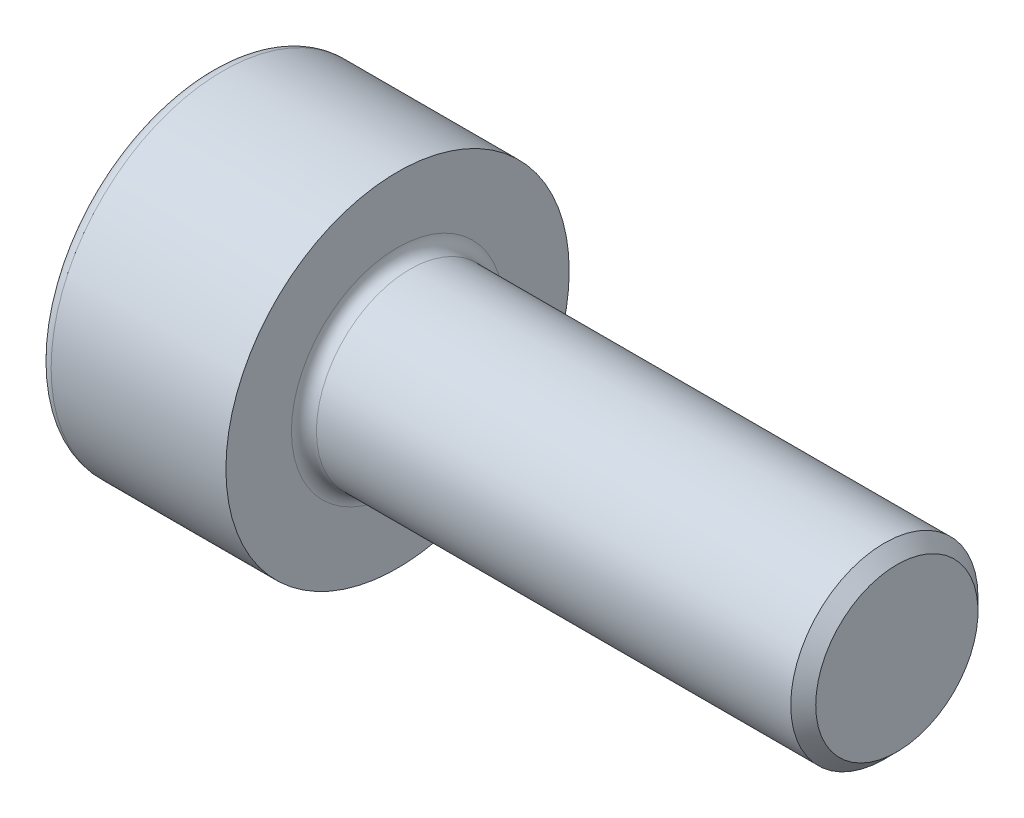
ISO-10303-21;
HEADER;
FILE_DESCRIPTION(('STEP AP214'),'2;1');
FILE_NAME('part.step','',(''),(''),'','','');
FILE_SCHEMA(('AUTOMOTIVE_DESIGN { 1 0 10303 214 1 1 1 1 }'));
ENDSEC;
DATA;
#1=APPLICATION_CONTEXT('core data for automotive mechanical design processes');
#2=APPLICATION_PROTOCOL_DEFINITION('international standard','automotive_design',2000,#1);
#3=PRODUCT_CONTEXT('',#1,'mechanical');
#4=PRODUCT('Part','Part','',(#3));
#5=PRODUCT_RELATED_PRODUCT_CATEGORY('part','',(#4));
#6=PRODUCT_DEFINITION_FORMATION('','',#4);
#7=PRODUCT_DEFINITION_CONTEXT('part definition',#1,'design');
#8=PRODUCT_DEFINITION('design','',#6,#7);
#9=PRODUCT_DEFINITION_SHAPE('','',#8);
#10=(LENGTH_UNIT() NAMED_UNIT(*) SI_UNIT(.MILLI.,.METRE.));
#11=(NAMED_UNIT(*) PLANE_ANGLE_UNIT() SI_UNIT($,.RADIAN.));
#12=(NAMED_UNIT(*) SI_UNIT($,.STERADIAN.) SOLID_ANGLE_UNIT());
#13=UNCERTAINTY_MEASURE_WITH_UNIT(LENGTH_MEASURE(1.E-05),#10,'distance_accuracy_value','');
#14=(GEOMETRIC_REPRESENTATION_CONTEXT(3) GLOBAL_UNCERTAINTY_ASSIGNED_CONTEXT((#13)) GLOBAL_UNIT_ASSIGNED_CONTEXT((#10,
#11,#12)) REPRESENTATION_CONTEXT('',''));
#15=CARTESIAN_POINT('',(0.,0.,0.));
#16=DIRECTION('',(0.,0.,1.));
#17=DIRECTION('',(1.,0.,0.));
#18=AXIS2_PLACEMENT_3D('',#15,#16,#17);
#19=CARTESIAN_POINT('',(0.,0.,0.));
#20=DIRECTION('',(1.,0.,0.));
#21=DIRECTION('',(0.,0.,-1.));
#22=AXIS2_PLACEMENT_3D('',#19,#20,#21);
#23=PLANE('',#22);
#24=DIRECTION('',(0.,0.866025403784439,0.5));
#25=VECTOR('',#24,1.);
#26=CARTESIAN_POINT('',(0.,-1.28,0.739008344562721));
#27=LINE('',#26,#25);
#28=CARTESIAN_POINT('',(0.,-1.28,0.739008344562721));
#29=VERTEX_POINT('',#28);
#30=CARTESIAN_POINT('',(0.,0.,1.47801668912544));
#31=VERTEX_POINT('',#30);
#32=EDGE_CURVE('E121',#29,#31,#27,.T.);
#33=ORIENTED_EDGE('',*,*,#32,.F.);
#34=DIRECTION('',(0.,0.,1.));
#35=VECTOR('',#34,1.);
#36=CARTESIAN_POINT('',(0.,-1.28,-0.739008344562721));
#37=LINE('',#36,#35);
#38=CARTESIAN_POINT('',(0.,-1.28,-0.739008344562721));
#39=VERTEX_POINT('',#38);
#40=EDGE_CURVE('E47',#39,#29,#37,.T.);
#41=ORIENTED_EDGE('',*,*,#40,.F.);
#42=DIRECTION('',(0.,-0.866025403784439,0.5));
#43=VECTOR('',#42,1.);
#44=CARTESIAN_POINT('',(0.,0.,-1.47801668912544));
#45=LINE('',#44,#43);
#46=CARTESIAN_POINT('',(0.,0.,-1.47801668912544));
#47=VERTEX_POINT('',#46);
#48=EDGE_CURVE('E130',#47,#39,#45,.T.);
#49=ORIENTED_EDGE('',*,*,#48,.F.);
#50=DIRECTION('',(0.,-0.866025403784439,-0.5));
#51=VECTOR('',#50,1.);
#52=CARTESIAN_POINT('',(0.,1.28,-0.739008344562721));
#53=LINE('',#52,#51);
#54=CARTESIAN_POINT('',(0.,1.28,-0.739008344562721));
#55=VERTEX_POINT('',#54);
#56=EDGE_CURVE('E128',#55,#47,#53,.T.);
#57=ORIENTED_EDGE('',*,*,#56,.F.);
#58=DIRECTION('',(0.,0.,-1.));
#59=VECTOR('',#58,1.);
#60=CARTESIAN_POINT('',(0.,1.28,0.739008344562721));
#61=LINE('',#60,#59);
#62=CARTESIAN_POINT('',(0.,1.28,0.739008344562721));
#63=VERTEX_POINT('',#62);
#64=EDGE_CURVE('E95',#63,#55,#61,.T.);
#65=ORIENTED_EDGE('',*,*,#64,.F.);
#66=DIRECTION('',(0.,0.866025403784438,-0.5));
#67=VECTOR('',#66,1.);
#68=CARTESIAN_POINT('',(0.,0.,1.47801668912544));
#69=LINE('',#68,#67);
#70=EDGE_CURVE('E124',#31,#63,#69,.T.);
#71=ORIENTED_EDGE('',*,*,#70,.F.);
#72=EDGE_LOOP('',(#33,#41,#49,#57,#65,#71));
#73=FACE_BOUND('',#72,.T.);
#74=CARTESIAN_POINT('',(0.,0.,0.));
#75=DIRECTION('',(1.,0.,0.));
#76=DIRECTION('',(0.,0.,-1.));
#77=AXIS2_PLACEMENT_3D('',#74,#75,#76);
#78=CIRCLE('',#77,2.55);
#79=CARTESIAN_POINT('',(0.,0.,-2.55));
#80=VERTEX_POINT('',#79);
#81=EDGE_CURVE('E40',#80,#80,#78,.F.);
#82=ORIENTED_EDGE('',*,*,#81,.T.);
#83=EDGE_LOOP('',(#82));
#84=FACE_BOUND('',#83,.T.);
#85=ADVANCED_FACE('F32',(#73,#84),#23,.F.);
#86=CARTESIAN_POINT('',(0.,0.,0.));
#87=DIRECTION('',(-1.,0.,0.));
#88=DIRECTION('',(0.,0.,1.));
#89=AXIS2_PLACEMENT_3D('',#86,#87,#88);
#90=CYLINDRICAL_SURFACE('',#89,2.75);
#91=CARTESIAN_POINT('',(0.2,0.,0.));
#92=DIRECTION('',(1.,0.,0.));
#93=DIRECTION('',(0.,0.,-1.));
#94=AXIS2_PLACEMENT_3D('',#91,#92,#93);
#95=CIRCLE('',#94,2.75);
#96=CARTESIAN_POINT('',(0.2,0.,-2.75));
#97=VERTEX_POINT('',#96);
#98=EDGE_CURVE('E11',#97,#97,#95,.T.);
#99=ORIENTED_EDGE('',*,*,#98,.T.);
#100=EDGE_LOOP('',(#99));
#101=FACE_BOUND('',#100,.T.);
#102=CARTESIAN_POINT('',(3.,0.,0.));
#103=DIRECTION('',(-1.,0.,0.));
#104=DIRECTION('',(0.,0.,1.));
#105=AXIS2_PLACEMENT_3D('',#102,#103,#104);
#106=CIRCLE('',#105,2.75);
#107=CARTESIAN_POINT('',(3.,0.,2.75));
#108=VERTEX_POINT('',#107);
#109=EDGE_CURVE('E134',#108,#108,#106,.T.);
#110=ORIENTED_EDGE('',*,*,#109,.T.);
#111=EDGE_LOOP('',(#110));
#112=FACE_BOUND('',#111,.T.);
#113=ADVANCED_FACE('F171',(#101,#112),#90,.T.);
#114=CARTESIAN_POINT('',(3.,2.75,0.));
#115=DIRECTION('',(-1.,0.,0.));
#116=DIRECTION('',(0.,0.,1.));
#117=AXIS2_PLACEMENT_3D('',#114,#115,#116);
#118=PLANE('',#117);
#119=CARTESIAN_POINT('',(3.,0.,0.));
#120=DIRECTION('',(-1.,0.,0.));
#121=DIRECTION('',(0.,0.,1.));
#122=AXIS2_PLACEMENT_3D('',#119,#120,#121);
#123=CIRCLE('',#122,1.7);
#124=CARTESIAN_POINT('',(3.,0.,1.7));
#125=VERTEX_POINT('',#124);
#126=EDGE_CURVE('E148',#125,#125,#123,.T.);
#127=ORIENTED_EDGE('',*,*,#126,.T.);
#128=EDGE_LOOP('',(#127));
#129=FACE_BOUND('',#128,.T.);
#130=ORIENTED_EDGE('',*,*,#109,.F.);
#131=EDGE_LOOP('',(#130));
#132=FACE_BOUND('',#131,.T.);
#133=ADVANCED_FACE('F177',(#129,#132),#118,.F.);
#134=CARTESIAN_POINT('',(0.,0.,0.));
#135=DIRECTION('',(-1.,0.,0.));
#136=DIRECTION('',(0.,0.,1.));
#137=AXIS2_PLACEMENT_3D('',#134,#135,#136);
#138=CYLINDRICAL_SURFACE('',#137,1.5);
#139=CARTESIAN_POINT('',(3.2,0.,0.));
#140=DIRECTION('',(-1.,0.,0.));
#141=DIRECTION('',(0.,0.,1.));
#142=AXIS2_PLACEMENT_3D('',#139,#140,#141);
#143=CIRCLE('',#142,1.5);
#144=CARTESIAN_POINT('',(3.2,0.,1.5));
#145=VERTEX_POINT('',#144);
#146=EDGE_CURVE('E151',#145,#145,#143,.F.);
#147=ORIENTED_EDGE('',*,*,#146,.T.);
#148=EDGE_LOOP('',(#147));
#149=FACE_BOUND('',#148,.T.);
#150=CARTESIAN_POINT('',(10.8,0.,0.));
#151=DIRECTION('',(-1.,0.,0.));
#152=DIRECTION('',(0.,0.,1.));
#153=AXIS2_PLACEMENT_3D('',#150,#151,#152);
#154=CIRCLE('',#153,1.5);
#155=CARTESIAN_POINT('',(10.8,0.,1.5));
#156=VERTEX_POINT('',#155);
#157=EDGE_CURVE('E142',#156,#156,#154,.T.);
#158=ORIENTED_EDGE('',*,*,#157,.T.);
#159=EDGE_LOOP('',(#158));
#160=FACE_BOUND('',#159,.T.);
#161=ADVANCED_FACE('F189',(#149,#160),#138,.T.);
#162=CARTESIAN_POINT('',(11.,1.5,0.));
#163=DIRECTION('',(-1.,0.,0.));
#164=DIRECTION('',(0.,0.,1.));
#165=AXIS2_PLACEMENT_3D('',#162,#163,#164);
#166=PLANE('',#165);
#167=CARTESIAN_POINT('',(11.,0.,0.));
#168=DIRECTION('',(-1.,0.,0.));
#169=DIRECTION('',(0.,0.,1.));
#170=AXIS2_PLACEMENT_3D('',#167,#168,#169);
#171=CIRCLE('',#170,1.3);
#172=CARTESIAN_POINT('',(11.,0.,1.3));
#173=VERTEX_POINT('',#172);
#174=EDGE_CURVE('E145',#173,#173,#171,.F.);
#175=ORIENTED_EDGE('',*,*,#174,.T.);
#176=EDGE_LOOP('',(#175));
#177=FACE_BOUND('',#176,.T.);
#178=ADVANCED_FACE('F184',(#177),#166,.F.);
#179=CARTESIAN_POINT('',(10.8,0.,0.));
#180=DIRECTION('',(-1.,0.,0.));
#181=DIRECTION('',(0.,0.,1.));
#182=AXIS2_PLACEMENT_3D('',#179,#180,#181);
#183=CONICAL_SURFACE('',#182,1.5,0.785398163397445);
#184=ORIENTED_EDGE('',*,*,#174,.F.);
#185=EDGE_LOOP('',(#184));
#186=FACE_BOUND('',#185,.T.);
#187=ORIENTED_EDGE('',*,*,#157,.F.);
#188=EDGE_LOOP('',(#187));
#189=FACE_BOUND('',#188,.T.);
#190=ADVANCED_FACE('F167',(#186,#189),#183,.T.);
#191=CARTESIAN_POINT('',(3.2,0.,0.));
#192=DIRECTION('',(-1.,0.,0.));
#193=DIRECTION('',(0.,0.,1.));
#194=AXIS2_PLACEMENT_3D('',#191,#192,#193);
#195=TOROIDAL_SURFACE('',#194,1.7,0.2);
#196=ORIENTED_EDGE('',*,*,#146,.F.);
#197=EDGE_LOOP('',(#196));
#198=FACE_BOUND('',#197,.T.);
#199=ORIENTED_EDGE('',*,*,#126,.F.);
#200=EDGE_LOOP('',(#199));
#201=FACE_BOUND('',#200,.T.);
#202=ADVANCED_FACE('F159',(#198,#201),#195,.F.);
#203=CARTESIAN_POINT('',(0.2,0.,0.));
#204=DIRECTION('',(1.,0.,0.));
#205=DIRECTION('',(0.,0.,-1.));
#206=AXIS2_PLACEMENT_3D('',#203,#204,#205);
#207=TOROIDAL_SURFACE('',#206,2.55,0.2);
#208=ORIENTED_EDGE('',*,*,#98,.F.);
#209=EDGE_LOOP('',(#208));
#210=FACE_BOUND('',#209,.T.);
#211=ORIENTED_EDGE('',*,*,#81,.F.);
#212=EDGE_LOOP('',(#211));
#213=FACE_BOUND('',#212,.T.);
#214=ADVANCED_FACE('F34',(#210,#213),#207,.T.);
#215=CARTESIAN_POINT('',(1.3,-1.28,-0.739008344562721));
#216=DIRECTION('',(0.,-1.,0.));
#217=DIRECTION('',(0.,0.,-1.));
#218=AXIS2_PLACEMENT_3D('',#215,#216,#217);
#219=PLANE('',#218);
#220=ORIENTED_EDGE('',*,*,#40,.T.);
#221=DIRECTION('',(-1.,0.,0.));
#222=VECTOR('',#221,1.);
#223=CARTESIAN_POINT('',(1.3,-1.28,0.739008344562721));
#224=LINE('',#223,#222);
#225=CARTESIAN_POINT('',(1.3,-1.28,0.739008344562721));
#226=VERTEX_POINT('',#225);
#227=EDGE_CURVE('E77',#226,#29,#224,.T.);
#228=ORIENTED_EDGE('',*,*,#227,.F.);
#229=DIRECTION('',(0.,0.,1.));
#230=VECTOR('',#229,1.);
#231=CARTESIAN_POINT('',(1.3,-1.28,-0.739008344562721));
#232=LINE('',#231,#230);
#233=CARTESIAN_POINT('',(1.3,-1.28,-0.739008344562721));
#234=VERTEX_POINT('',#233);
#235=EDGE_CURVE('E132',#234,#226,#232,.T.);
#236=ORIENTED_EDGE('',*,*,#235,.F.);
#237=DIRECTION('',(-1.,0.,0.));
#238=VECTOR('',#237,1.);
#239=CARTESIAN_POINT('',(1.3,-1.28,-0.739008344562721));
#240=LINE('',#239,#238);
#241=EDGE_CURVE('E55',#234,#39,#240,.T.);
#242=ORIENTED_EDGE('',*,*,#241,.T.);
#243=EDGE_LOOP('',(#220,#228,#236,#242));
#244=FACE_BOUND('',#243,.T.);
#245=ADVANCED_FACE('F158',(#244),#219,.F.);
#246=CARTESIAN_POINT('',(1.3,0.,-1.47801668912544));
#247=DIRECTION('',(0.,-0.5,-0.866025403784439));
#248=DIRECTION('',(0.,0.866025403784439,-0.5));
#249=AXIS2_PLACEMENT_3D('',#246,#247,#248);
#250=PLANE('',#249);
#251=ORIENTED_EDGE('',*,*,#48,.T.);
#252=ORIENTED_EDGE('',*,*,#241,.F.);
#253=DIRECTION('',(0.,-0.866025403784439,0.5));
#254=VECTOR('',#253,1.);
#255=CARTESIAN_POINT('',(1.3,0.,-1.47801668912544));
#256=LINE('',#255,#254);
#257=CARTESIAN_POINT('',(1.3,0.,-1.47801668912544));
#258=VERTEX_POINT('',#257);
#259=EDGE_CURVE('E107',#258,#234,#256,.T.);
#260=ORIENTED_EDGE('',*,*,#259,.F.);
#261=DIRECTION('',(-1.,0.,0.));
#262=VECTOR('',#261,1.);
#263=CARTESIAN_POINT('',(1.3,0.,-1.47801668912544));
#264=LINE('',#263,#262);
#265=EDGE_CURVE('E99',#258,#47,#264,.T.);
#266=ORIENTED_EDGE('',*,*,#265,.T.);
#267=EDGE_LOOP('',(#251,#252,#260,#266));
#268=FACE_BOUND('',#267,.T.);
#269=ADVANCED_FACE('F165',(#268),#250,.F.);
#270=CARTESIAN_POINT('',(1.3,1.28,-0.739008344562721));
#271=DIRECTION('',(0.,0.5,-0.866025403784439));
#272=DIRECTION('',(0.,0.866025403784439,0.5));
#273=AXIS2_PLACEMENT_3D('',#270,#271,#272);
#274=PLANE('',#273);
#275=ORIENTED_EDGE('',*,*,#56,.T.);
#276=ORIENTED_EDGE('',*,*,#265,.F.);
#277=DIRECTION('',(0.,-0.866025403784439,-0.5));
#278=VECTOR('',#277,1.);
#279=CARTESIAN_POINT('',(1.3,1.28,-0.739008344562721));
#280=LINE('',#279,#278);
#281=CARTESIAN_POINT('',(1.3,1.28,-0.739008344562721));
#282=VERTEX_POINT('',#281);
#283=EDGE_CURVE('E103',#282,#258,#280,.T.);
#284=ORIENTED_EDGE('',*,*,#283,.F.);
#285=DIRECTION('',(-1.,0.,0.));
#286=VECTOR('',#285,1.);
#287=CARTESIAN_POINT('',(1.3,1.28,-0.739008344562721));
#288=LINE('',#287,#286);
#289=EDGE_CURVE('E88',#282,#55,#288,.T.);
#290=ORIENTED_EDGE('',*,*,#289,.T.);
#291=EDGE_LOOP('',(#275,#276,#284,#290));
#292=FACE_BOUND('',#291,.T.);
#293=ADVANCED_FACE('F104',(#292),#274,.F.);
#294=CARTESIAN_POINT('',(1.3,1.28,0.739008344562721));
#295=DIRECTION('',(0.,1.,0.));
#296=DIRECTION('',(0.,0.,1.));
#297=AXIS2_PLACEMENT_3D('',#294,#295,#296);
#298=PLANE('',#297);
#299=ORIENTED_EDGE('',*,*,#64,.T.);
#300=ORIENTED_EDGE('',*,*,#289,.F.);
#301=DIRECTION('',(0.,0.,-1.));
#302=VECTOR('',#301,1.);
#303=CARTESIAN_POINT('',(1.3,1.28,0.739008344562721));
#304=LINE('',#303,#302);
#305=CARTESIAN_POINT('',(1.3,1.28,0.739008344562721));
#306=VERTEX_POINT('',#305);
#307=EDGE_CURVE('E92',#306,#282,#304,.T.);
#308=ORIENTED_EDGE('',*,*,#307,.F.);
#309=DIRECTION('',(-1.,0.,0.));
#310=VECTOR('',#309,1.);
#311=CARTESIAN_POINT('',(1.3,1.28,0.739008344562721));
#312=LINE('',#311,#310);
#313=EDGE_CURVE('E100',#306,#63,#312,.T.);
#314=ORIENTED_EDGE('',*,*,#313,.T.);
#315=EDGE_LOOP('',(#299,#300,#308,#314));
#316=FACE_BOUND('',#315,.T.);
#317=ADVANCED_FACE('F90',(#316),#298,.F.);
#318=CARTESIAN_POINT('',(1.3,0.,1.47801668912544));
#319=DIRECTION('',(0.,0.5,0.866025403784438));
#320=DIRECTION('',(0.,-0.866025403784439,0.5));
#321=AXIS2_PLACEMENT_3D('',#318,#319,#320);
#322=PLANE('',#321);
#323=ORIENTED_EDGE('',*,*,#70,.T.);
#324=ORIENTED_EDGE('',*,*,#313,.F.);
#325=DIRECTION('',(0.,0.866025403784438,-0.5));
#326=VECTOR('',#325,1.);
#327=CARTESIAN_POINT('',(1.3,0.,1.47801668912544));
#328=LINE('',#327,#326);
#329=CARTESIAN_POINT('',(1.3,0.,1.47801668912544));
#330=VERTEX_POINT('',#329);
#331=EDGE_CURVE('E113',#330,#306,#328,.T.);
#332=ORIENTED_EDGE('',*,*,#331,.F.);
#333=DIRECTION('',(-1.,0.,0.));
#334=VECTOR('',#333,1.);
#335=CARTESIAN_POINT('',(1.3,0.,1.47801668912544));
#336=LINE('',#335,#334);
#337=EDGE_CURVE('E137',#330,#31,#336,.T.);
#338=ORIENTED_EDGE('',*,*,#337,.T.);
#339=EDGE_LOOP('',(#323,#324,#332,#338));
#340=FACE_BOUND('',#339,.T.);
#341=ADVANCED_FACE('F207',(#340),#322,.F.);
#342=CARTESIAN_POINT('',(1.3,-1.28,0.739008344562721));
#343=DIRECTION('',(0.,-0.5,0.866025403784439));
#344=DIRECTION('',(0.,-0.866025403784439,-0.5));
#345=AXIS2_PLACEMENT_3D('',#342,#343,#344);
#346=PLANE('',#345);
#347=ORIENTED_EDGE('',*,*,#32,.T.);
#348=ORIENTED_EDGE('',*,*,#337,.F.);
#349=DIRECTION('',(0.,0.866025403784439,0.5));
#350=VECTOR('',#349,1.);
#351=CARTESIAN_POINT('',(1.3,-1.28,0.739008344562721));
#352=LINE('',#351,#350);
#353=EDGE_CURVE('E115',#226,#330,#352,.T.);
#354=ORIENTED_EDGE('',*,*,#353,.F.);
#355=ORIENTED_EDGE('',*,*,#227,.T.);
#356=EDGE_LOOP('',(#347,#348,#354,#355));
#357=FACE_BOUND('',#356,.T.);
#358=ADVANCED_FACE('F204',(#357),#346,.F.);
#359=CARTESIAN_POINT('',(1.3,0.,0.));
#360=DIRECTION('',(-1.,0.,0.));
#361=DIRECTION('',(0.,0.,1.));
#362=AXIS2_PLACEMENT_3D('',#359,#360,#361);
#363=PLANE('',#362);
#364=ORIENTED_EDGE('',*,*,#235,.T.);
#365=ORIENTED_EDGE('',*,*,#353,.T.);
#366=ORIENTED_EDGE('',*,*,#331,.T.);
#367=ORIENTED_EDGE('',*,*,#307,.T.);
#368=ORIENTED_EDGE('',*,*,#283,.T.);
#369=ORIENTED_EDGE('',*,*,#259,.T.);
#370=EDGE_LOOP('',(#364,#365,#366,#367,#368,#369));
#371=FACE_BOUND('',#370,.T.);
#372=ADVANCED_FACE('F110',(#371),#363,.T.);
#373=CLOSED_SHELL('',(#85,#113,#133,#161,#178,#190,#202,#214,#245,#269,#293,#317,#341,#358,#372));
#374=MANIFOLD_SOLID_BREP('B2',#373);
#375=ADVANCED_BREP_SHAPE_REPRESENTATION('',(#18,#374),#14);
#376=SHAPE_DEFINITION_REPRESENTATION(#9,#375);
ENDSEC;
END-ISO-10303-21;
